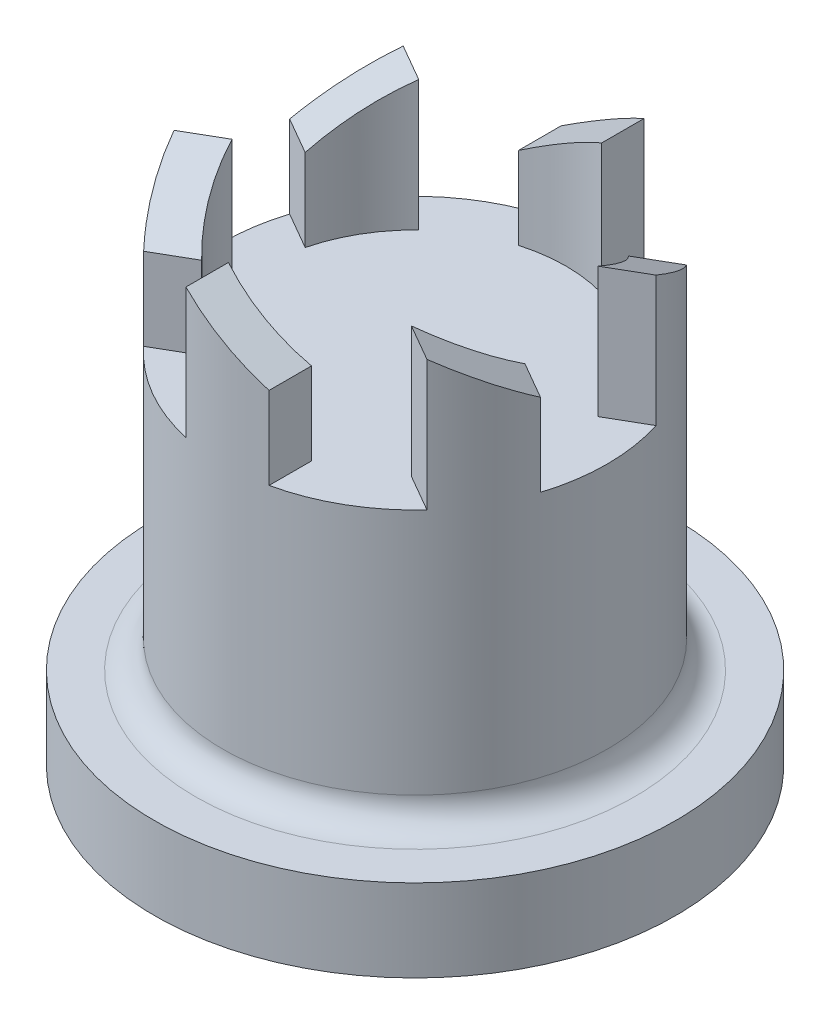
ISO-10303-21;
HEADER;
FILE_DESCRIPTION(('STEP AP214'),'2;1');
FILE_NAME('part.step','',(''),(''),'','','');
FILE_SCHEMA(('AUTOMOTIVE_DESIGN { 1 0 10303 214 1 1 1 1 }'));
ENDSEC;
DATA;
#1=APPLICATION_CONTEXT('core data for automotive mechanical design processes');
#2=APPLICATION_PROTOCOL_DEFINITION('international standard','automotive_design',2000,#1);
#3=PRODUCT_CONTEXT('',#1,'mechanical');
#4=PRODUCT('Part','Part','',(#3));
#5=PRODUCT_RELATED_PRODUCT_CATEGORY('part','',(#4));
#6=PRODUCT_DEFINITION_FORMATION('','',#4);
#7=PRODUCT_DEFINITION_CONTEXT('part definition',#1,'design');
#8=PRODUCT_DEFINITION('design','',#6,#7);
#9=PRODUCT_DEFINITION_SHAPE('','',#8);
#10=(LENGTH_UNIT() NAMED_UNIT(*) SI_UNIT(.MILLI.,.METRE.));
#11=(NAMED_UNIT(*) PLANE_ANGLE_UNIT() SI_UNIT($,.RADIAN.));
#12=(NAMED_UNIT(*) SI_UNIT($,.STERADIAN.) SOLID_ANGLE_UNIT());
#13=UNCERTAINTY_MEASURE_WITH_UNIT(LENGTH_MEASURE(1.E-05),#10,'distance_accuracy_value','');
#14=(GEOMETRIC_REPRESENTATION_CONTEXT(3) GLOBAL_UNCERTAINTY_ASSIGNED_CONTEXT((#13)) GLOBAL_UNIT_ASSIGNED_CONTEXT((#10,
#11,#12)) REPRESENTATION_CONTEXT('',''));
#15=CARTESIAN_POINT('',(0.,0.,0.));
#16=DIRECTION('',(0.,0.,1.));
#17=DIRECTION('',(1.,0.,0.));
#18=AXIS2_PLACEMENT_3D('',#15,#16,#17);
#19=CARTESIAN_POINT('',(0.,10.,0.));
#20=DIRECTION('',(0.,1.,0.));
#21=DIRECTION('',(0.,0.,1.));
#22=AXIS2_PLACEMENT_3D('',#19,#20,#21);
#23=PLANE('',#22);
#24=CARTESIAN_POINT('',(0.,10.,0.));
#25=DIRECTION('',(0.,1.,0.));
#26=DIRECTION('',(0.,0.,1.));
#27=AXIS2_PLACEMENT_3D('',#24,#25,#26);
#28=CIRCLE('',#27,7.);
#29=CARTESIAN_POINT('',(-6.67574526607751,10.,-2.10580747990972));
#30=VERTEX_POINT('',#29);
#31=CARTESIAN_POINT('',(-6.67574526607751,10.,2.10580747990973));
#32=VERTEX_POINT('',#31);
#33=EDGE_CURVE('E397',#30,#32,#28,.T.);
#34=ORIENTED_EDGE('',*,*,#33,.T.);
#35=DIRECTION('',(-0.866025403784438,0.,0.500000000000002));
#36=VECTOR('',#35,1.);
#37=CARTESIAN_POINT('',(-0.757094929978831,10.,-1.31132688487613));
#38=LINE('',#37,#36);
#39=CARTESIAN_POINT('',(-5.33616926886011,10.,1.3324029173163));
#40=VERTEX_POINT('',#39);
#41=EDGE_CURVE('E256',#40,#32,#38,.T.);
#42=ORIENTED_EDGE('',*,*,#41,.F.);
#43=CARTESIAN_POINT('',(0.,10.,0.));
#44=DIRECTION('',(0.,1.,0.));
#45=DIRECTION('',(0.,0.,1.));
#46=AXIS2_PLACEMENT_3D('',#43,#44,#45);
#47=CIRCLE('',#46,5.5);
#48=CARTESIAN_POINT('',(-3.82197940890246,10.,3.95505668706855));
#49=VERTEX_POINT('',#48);
#50=EDGE_CURVE('E249',#40,#49,#47,.T.);
#51=ORIENTED_EDGE('',*,*,#50,.T.);
#52=DIRECTION('',(0.866025403784439,0.,-0.5));
#53=VECTOR('',#52,1.);
#54=CARTESIAN_POINT('',(0.757094929978827,10.,1.31132688487613));
#55=LINE('',#54,#53);
#56=CARTESIAN_POINT('',(-5.16155540611986,10.,4.72846124966197));
#57=VERTEX_POINT('',#56);
#58=EDGE_CURVE('E260',#57,#49,#55,.T.);
#59=ORIENTED_EDGE('',*,*,#58,.F.);
#60=CARTESIAN_POINT('',(-1.51418985995765,10.,6.83426872957169));
#61=VERTEX_POINT('',#60);
#62=EDGE_CURVE('E402',#57,#61,#28,.T.);
#63=ORIENTED_EDGE('',*,*,#62,.T.);
#64=DIRECTION('',(0.,0.,1.));
#65=VECTOR('',#64,1.);
#66=CARTESIAN_POINT('',(-1.51418985995765,10.,0.));
#67=LINE('',#66,#65);
#68=CARTESIAN_POINT('',(-1.51418985995765,10.,5.28745960438483));
#69=VERTEX_POINT('',#68);
#70=EDGE_CURVE('E280',#69,#61,#67,.T.);
#71=ORIENTED_EDGE('',*,*,#70,.F.);
#72=CARTESIAN_POINT('',(0.,10.,0.));
#73=DIRECTION('',(0.,1.,0.));
#74=DIRECTION('',(0.,0.,1.));
#75=AXIS2_PLACEMENT_3D('',#72,#73,#74);
#76=CIRCLE('',#75,5.5);
#77=CARTESIAN_POINT('',(1.51418985995765,10.,5.28745960438483));
#78=VERTEX_POINT('',#77);
#79=EDGE_CURVE('E276',#69,#78,#76,.T.);
#80=ORIENTED_EDGE('',*,*,#79,.T.);
#81=DIRECTION('',(0.,0.,-1.));
#82=VECTOR('',#81,1.);
#83=CARTESIAN_POINT('',(1.51418985995765,10.,0.));
#84=LINE('',#83,#82);
#85=CARTESIAN_POINT('',(1.51418985995765,10.,6.83426872957169));
#86=VERTEX_POINT('',#85);
#87=EDGE_CURVE('E284',#86,#78,#84,.T.);
#88=ORIENTED_EDGE('',*,*,#87,.F.);
#89=CARTESIAN_POINT('',(5.16155540611986,10.,4.72846124966197));
#90=VERTEX_POINT('',#89);
#91=EDGE_CURVE('E565',#86,#90,#28,.T.);
#92=ORIENTED_EDGE('',*,*,#91,.T.);
#93=DIRECTION('',(0.86602540378444,0.,0.499999999999999));
#94=VECTOR('',#93,1.);
#95=CARTESIAN_POINT('',(-0.757094929978826,10.,1.31132688487613));
#96=LINE('',#95,#94);
#97=CARTESIAN_POINT('',(3.82197940890246,10.,3.95505668706854));
#98=VERTEX_POINT('',#97);
#99=EDGE_CURVE('E304',#98,#90,#96,.T.);
#100=ORIENTED_EDGE('',*,*,#99,.F.);
#101=CARTESIAN_POINT('',(0.,10.,0.));
#102=DIRECTION('',(0.,1.,0.));
#103=DIRECTION('',(0.,0.,1.));
#104=AXIS2_PLACEMENT_3D('',#101,#102,#103);
#105=CIRCLE('',#104,5.5);
#106=CARTESIAN_POINT('',(5.33616926886011,10.,1.33240291731629));
#107=VERTEX_POINT('',#106);
#108=EDGE_CURVE('E300',#98,#107,#105,.T.);
#109=ORIENTED_EDGE('',*,*,#108,.T.);
#110=DIRECTION('',(-0.866025403784438,0.,-0.500000000000001));
#111=VECTOR('',#110,1.);
#112=CARTESIAN_POINT('',(0.757094929978829,10.,-1.31132688487613));
#113=LINE('',#112,#111);
#114=CARTESIAN_POINT('',(6.67574526607751,10.,2.10580747990972));
#115=VERTEX_POINT('',#114);
#116=EDGE_CURVE('E308',#115,#107,#113,.T.);
#117=ORIENTED_EDGE('',*,*,#116,.F.);
#118=CARTESIAN_POINT('',(6.67574526607751,10.,-2.10580747990972));
#119=VERTEX_POINT('',#118);
#120=EDGE_CURVE('E560',#115,#119,#28,.T.);
#121=ORIENTED_EDGE('',*,*,#120,.T.);
#122=DIRECTION('',(0.866025403784438,0.,-0.500000000000001));
#123=VECTOR('',#122,1.);
#124=CARTESIAN_POINT('',(0.757094929978829,10.,1.31132688487613));
#125=LINE('',#124,#123);
#126=CARTESIAN_POINT('',(5.33616926886011,10.,-1.33240291731629));
#127=VERTEX_POINT('',#126);
#128=EDGE_CURVE('E328',#127,#119,#125,.T.);
#129=ORIENTED_EDGE('',*,*,#128,.F.);
#130=CARTESIAN_POINT('',(0.,10.,0.));
#131=DIRECTION('',(0.,1.,0.));
#132=DIRECTION('',(0.,0.,1.));
#133=AXIS2_PLACEMENT_3D('',#130,#131,#132);
#134=CIRCLE('',#133,5.5);
#135=CARTESIAN_POINT('',(3.82197940890246,10.,-3.95505668706854));
#136=VERTEX_POINT('',#135);
#137=EDGE_CURVE('E324',#127,#136,#134,.T.);
#138=ORIENTED_EDGE('',*,*,#137,.T.);
#139=DIRECTION('',(-0.86602540378444,0.,0.499999999999999));
#140=VECTOR('',#139,1.);
#141=CARTESIAN_POINT('',(-0.757094929978826,10.,-1.31132688487613));
#142=LINE('',#141,#140);
#143=CARTESIAN_POINT('',(5.16155540611986,10.,-4.72846124966197));
#144=VERTEX_POINT('',#143);
#145=EDGE_CURVE('E332',#144,#136,#142,.T.);
#146=ORIENTED_EDGE('',*,*,#145,.F.);
#147=CARTESIAN_POINT('',(1.51418985995765,10.,-6.83426872957169));
#148=VERTEX_POINT('',#147);
#149=EDGE_CURVE('E566',#144,#148,#28,.T.);
#150=ORIENTED_EDGE('',*,*,#149,.T.);
#151=DIRECTION('',(0.,0.,-1.));
#152=VECTOR('',#151,1.);
#153=CARTESIAN_POINT('',(1.51418985995766,10.,0.));
#154=LINE('',#153,#152);
#155=CARTESIAN_POINT('',(1.51418985995765,10.,-5.28745960438483));
#156=VERTEX_POINT('',#155);
#157=EDGE_CURVE('E352',#156,#148,#154,.T.);
#158=ORIENTED_EDGE('',*,*,#157,.F.);
#159=CARTESIAN_POINT('',(0.,10.,0.));
#160=DIRECTION('',(0.,1.,0.));
#161=DIRECTION('',(0.,0.,1.));
#162=AXIS2_PLACEMENT_3D('',#159,#160,#161);
#163=CIRCLE('',#162,5.5);
#164=CARTESIAN_POINT('',(-1.51418985995765,10.,-5.28745960438483));
#165=VERTEX_POINT('',#164);
#166=EDGE_CURVE('E348',#156,#165,#163,.T.);
#167=ORIENTED_EDGE('',*,*,#166,.T.);
#168=DIRECTION('',(0.,0.,1.));
#169=VECTOR('',#168,1.);
#170=CARTESIAN_POINT('',(-1.51418985995766,10.,0.));
#171=LINE('',#170,#169);
#172=CARTESIAN_POINT('',(-1.51418985995765,10.,-6.83426872957169));
#173=VERTEX_POINT('',#172);
#174=EDGE_CURVE('E356',#173,#165,#171,.T.);
#175=ORIENTED_EDGE('',*,*,#174,.F.);
#176=CARTESIAN_POINT('',(-5.16155540611986,10.,-4.72846124966197));
#177=VERTEX_POINT('',#176);
#178=EDGE_CURVE('E396',#173,#177,#28,.T.);
#179=ORIENTED_EDGE('',*,*,#178,.T.);
#180=DIRECTION('',(-0.866025403784439,0.,-0.5));
#181=VECTOR('',#180,1.);
#182=CARTESIAN_POINT('',(0.757094929978822,10.,-1.31132688487612));
#183=LINE('',#182,#181);
#184=CARTESIAN_POINT('',(-3.82197940890246,10.,-3.95505668706854));
#185=VERTEX_POINT('',#184);
#186=EDGE_CURVE('E376',#185,#177,#183,.T.);
#187=ORIENTED_EDGE('',*,*,#186,.F.);
#188=CARTESIAN_POINT('',(0.,10.,0.));
#189=DIRECTION('',(0.,1.,0.));
#190=DIRECTION('',(0.,0.,1.));
#191=AXIS2_PLACEMENT_3D('',#188,#189,#190);
#192=CIRCLE('',#191,5.5);
#193=CARTESIAN_POINT('',(-5.33616926886011,10.,-1.33240291731629));
#194=VERTEX_POINT('',#193);
#195=EDGE_CURVE('E372',#185,#194,#192,.T.);
#196=ORIENTED_EDGE('',*,*,#195,.T.);
#197=DIRECTION('',(0.866025403784438,0.,0.5));
#198=VECTOR('',#197,1.);
#199=CARTESIAN_POINT('',(-0.757094929978828,10.,1.31132688487613));
#200=LINE('',#199,#198);
#201=EDGE_CURVE('E380',#30,#194,#200,.T.);
#202=ORIENTED_EDGE('',*,*,#201,.F.);
#203=EDGE_LOOP('',(#34,#42,#51,#59,#63,#71,#80,#88,#92,#100,#109,#117,#121,#129,#138,#146,#150,
#158,#167,#175,#179,#187,#196,#202));
#204=FACE_BOUND('',#203,.T.);
#205=ADVANCED_FACE('F43',(#204),#23,.T.);
#206=CARTESIAN_POINT('',(0.,10.,0.));
#207=DIRECTION('',(0.,-1.,0.));
#208=DIRECTION('',(0.,0.,-1.));
#209=AXIS2_PLACEMENT_3D('',#206,#207,#208);
#210=CYLINDRICAL_SURFACE('',#209,7.);
#211=CARTESIAN_POINT('',(0.,0.999999999999999,0.));
#212=DIRECTION('',(0.,-1.,0.));
#213=DIRECTION('',(0.,0.,-1.));
#214=AXIS2_PLACEMENT_3D('',#211,#212,#213);
#215=CIRCLE('',#214,7.);
#216=CARTESIAN_POINT('',(0.,0.999999999999999,-7.));
#217=VERTEX_POINT('',#216);
#218=EDGE_CURVE('E52',#217,#217,#215,.F.);
#219=ORIENTED_EDGE('',*,*,#218,.T.);
#220=EDGE_LOOP('',(#219));
#221=FACE_BOUND('',#220,.T.);
#222=DIRECTION('',(0.,-1.,0.));
#223=VECTOR('',#222,1.);
#224=CARTESIAN_POINT('',(1.51418985995765,15.,6.83426872957169));
#225=LINE('',#224,#223);
#226=CARTESIAN_POINT('',(1.51418985995765,13.,6.83426872957169));
#227=VERTEX_POINT('',#226);
#228=EDGE_CURVE('E291',#227,#86,#225,.T.);
#229=ORIENTED_EDGE('',*,*,#228,.F.);
#230=CARTESIAN_POINT('',(0.,13.8742179232507,0.));
#231=DIRECTION('',(0.499999999999996,0.866025403784441,0.));
#232=DIRECTION('',(0.866025403784441,-0.499999999999997,0.));
#233=AXIS2_PLACEMENT_3D('',#230,#231,#232);
#234=ELLIPSE('',#233,8.08290376865474,7.);
#235=CARTESIAN_POINT('',(-1.51418985995765,14.7484358465015,6.83426872957169));
#236=VERTEX_POINT('',#235);
#237=EDGE_CURVE('E427',#227,#236,#234,.F.);
#238=ORIENTED_EDGE('',*,*,#237,.T.);
#239=DIRECTION('',(0.,-1.,0.));
#240=VECTOR('',#239,1.);
#241=CARTESIAN_POINT('',(-1.51418985995765,15.,6.83426872957169));
#242=LINE('',#241,#240);
#243=EDGE_CURVE('E294',#236,#61,#242,.T.);
#244=ORIENTED_EDGE('',*,*,#243,.T.);
#245=ORIENTED_EDGE('',*,*,#62,.F.);
#246=DIRECTION('',(0.,-1.,0.));
#247=VECTOR('',#246,1.);
#248=CARTESIAN_POINT('',(-5.16155540611986,15.,4.72846124966197));
#249=LINE('',#248,#247);
#250=CARTESIAN_POINT('',(-5.16155540611986,13.,4.72846124966197));
#251=VERTEX_POINT('',#250);
#252=EDGE_CURVE('E267',#251,#57,#249,.T.);
#253=ORIENTED_EDGE('',*,*,#252,.F.);
#254=CARTESIAN_POINT('',(0.,13.8742179232507,0.));
#255=DIRECTION('',(0.249999999999998,0.866025403784441,0.433012701892216));
#256=DIRECTION('',(0.43301270189222,-0.499999999999996,0.750000000000002));
#257=AXIS2_PLACEMENT_3D('',#254,#255,#256);
#258=ELLIPSE('',#257,8.08290376865474,7.);
#259=CARTESIAN_POINT('',(-6.67574526607751,14.7484358465015,2.10580747990973));
#260=VERTEX_POINT('',#259);
#261=EDGE_CURVE('E424',#251,#260,#258,.F.);
#262=ORIENTED_EDGE('',*,*,#261,.T.);
#263=DIRECTION('',(0.,-1.,0.));
#264=VECTOR('',#263,1.);
#265=CARTESIAN_POINT('',(-6.67574526607751,15.,2.10580747990973));
#266=LINE('',#265,#264);
#267=EDGE_CURVE('E270',#260,#32,#266,.T.);
#268=ORIENTED_EDGE('',*,*,#267,.T.);
#269=ORIENTED_EDGE('',*,*,#33,.F.);
#270=DIRECTION('',(0.,-1.,0.));
#271=VECTOR('',#270,1.);
#272=CARTESIAN_POINT('',(-6.67574526607751,15.,-2.10580747990972));
#273=LINE('',#272,#271);
#274=CARTESIAN_POINT('',(-6.67574526607751,13.,-2.10580747990972));
#275=VERTEX_POINT('',#274);
#276=EDGE_CURVE('E387',#275,#30,#273,.T.);
#277=ORIENTED_EDGE('',*,*,#276,.F.);
#278=CARTESIAN_POINT('',(0.,13.8742179232507,0.));
#279=DIRECTION('',(-0.249999999999998,0.866025403784441,0.433012701892216));
#280=DIRECTION('',(-0.433012701892221,-0.499999999999996,0.750000000000002));
#281=AXIS2_PLACEMENT_3D('',#278,#279,#280);
#282=ELLIPSE('',#281,8.08290376865474,7.);
#283=CARTESIAN_POINT('',(-5.16155540611986,14.7484358465015,-4.72846124966197));
#284=VERTEX_POINT('',#283);
#285=EDGE_CURVE('E421',#275,#284,#282,.F.);
#286=ORIENTED_EDGE('',*,*,#285,.T.);
#287=DIRECTION('',(0.,-1.,0.));
#288=VECTOR('',#287,1.);
#289=CARTESIAN_POINT('',(-5.16155540611986,15.,-4.72846124966197));
#290=LINE('',#289,#288);
#291=EDGE_CURVE('E390',#284,#177,#290,.T.);
#292=ORIENTED_EDGE('',*,*,#291,.T.);
#293=ORIENTED_EDGE('',*,*,#178,.F.);
#294=DIRECTION('',(0.,-1.,0.));
#295=VECTOR('',#294,1.);
#296=CARTESIAN_POINT('',(-1.51418985995765,15.,-6.83426872957169));
#297=LINE('',#296,#295);
#298=CARTESIAN_POINT('',(-1.51418985995765,13.,-6.83426872957169));
#299=VERTEX_POINT('',#298);
#300=EDGE_CURVE('E363',#299,#173,#297,.T.);
#301=ORIENTED_EDGE('',*,*,#300,.F.);
#302=CARTESIAN_POINT('',(0.,13.8742179232507,0.));
#303=DIRECTION('',(-0.499999999999996,0.866025403784441,0.));
#304=DIRECTION('',(-0.866025403784441,-0.499999999999997,0.));
#305=AXIS2_PLACEMENT_3D('',#302,#303,#304);
#306=ELLIPSE('',#305,8.08290376865474,7.);
#307=CARTESIAN_POINT('',(1.51418985995765,14.7484358465015,-6.83426872957169));
#308=VERTEX_POINT('',#307);
#309=EDGE_CURVE('E418',#299,#308,#306,.F.);
#310=ORIENTED_EDGE('',*,*,#309,.T.);
#311=DIRECTION('',(0.,-1.,0.));
#312=VECTOR('',#311,1.);
#313=CARTESIAN_POINT('',(1.51418985995765,15.,-6.83426872957169));
#314=LINE('',#313,#312);
#315=EDGE_CURVE('E366',#308,#148,#314,.T.);
#316=ORIENTED_EDGE('',*,*,#315,.T.);
#317=ORIENTED_EDGE('',*,*,#149,.F.);
#318=DIRECTION('',(0.,-1.,0.));
#319=VECTOR('',#318,1.);
#320=CARTESIAN_POINT('',(5.16155540611986,15.,-4.72846124966197));
#321=LINE('',#320,#319);
#322=CARTESIAN_POINT('',(5.16155540611986,13.,-4.72846124966197));
#323=VERTEX_POINT('',#322);
#324=EDGE_CURVE('E339',#323,#144,#321,.T.);
#325=ORIENTED_EDGE('',*,*,#324,.F.);
#326=CARTESIAN_POINT('',(0.,13.8742179232507,0.));
#327=DIRECTION('',(-0.249999999999998,0.866025403784441,-0.433012701892217));
#328=DIRECTION('',(-0.433012701892219,-0.499999999999997,-0.750000000000002));
#329=AXIS2_PLACEMENT_3D('',#326,#327,#328);
#330=ELLIPSE('',#329,8.08290376865474,7.);
#331=CARTESIAN_POINT('',(6.67574526607751,14.7484358465015,-2.10580747990972));
#332=VERTEX_POINT('',#331);
#333=EDGE_CURVE('E415',#323,#332,#330,.F.);
#334=ORIENTED_EDGE('',*,*,#333,.T.);
#335=DIRECTION('',(0.,-1.,0.));
#336=VECTOR('',#335,1.);
#337=CARTESIAN_POINT('',(6.67574526607751,15.,-2.10580747990972));
#338=LINE('',#337,#336);
#339=EDGE_CURVE('E342',#332,#119,#338,.T.);
#340=ORIENTED_EDGE('',*,*,#339,.T.);
#341=ORIENTED_EDGE('',*,*,#120,.F.);
#342=DIRECTION('',(0.,-1.,0.));
#343=VECTOR('',#342,1.);
#344=CARTESIAN_POINT('',(6.67574526607751,15.,2.10580747990972));
#345=LINE('',#344,#343);
#346=CARTESIAN_POINT('',(6.67574526607751,13.,2.10580747990972));
#347=VERTEX_POINT('',#346);
#348=EDGE_CURVE('E315',#347,#115,#345,.T.);
#349=ORIENTED_EDGE('',*,*,#348,.F.);
#350=CARTESIAN_POINT('',(0.,13.8742179232507,0.));
#351=DIRECTION('',(0.249999999999999,0.866025403784441,-0.433012701892216));
#352=DIRECTION('',(0.433012701892221,-0.499999999999997,-0.750000000000001));
#353=AXIS2_PLACEMENT_3D('',#350,#351,#352);
#354=ELLIPSE('',#353,8.08290376865474,7.);
#355=CARTESIAN_POINT('',(5.16155540611986,14.7484358465015,4.72846124966197));
#356=VERTEX_POINT('',#355);
#357=EDGE_CURVE('E412',#347,#356,#354,.F.);
#358=ORIENTED_EDGE('',*,*,#357,.T.);
#359=DIRECTION('',(0.,-1.,0.));
#360=VECTOR('',#359,1.);
#361=CARTESIAN_POINT('',(5.16155540611986,15.,4.72846124966197));
#362=LINE('',#361,#360);
#363=EDGE_CURVE('E318',#356,#90,#362,.T.);
#364=ORIENTED_EDGE('',*,*,#363,.T.);
#365=ORIENTED_EDGE('',*,*,#91,.F.);
#366=EDGE_LOOP('',(#229,#238,#244,#245,#253,#262,#268,#269,#277,#286,#292,#293,#301,#310,#316,
#317,#325,#334,#340,#341,#349,#358,#364,#365));
#367=FACE_BOUND('',#366,.T.);
#368=ADVANCED_FACE('F482',(#221,#367),#210,.T.);
#369=CARTESIAN_POINT('',(0.,15.,0.));
#370=DIRECTION('',(0.,-1.,0.));
#371=DIRECTION('',(0.,0.,-1.));
#372=AXIS2_PLACEMENT_3D('',#369,#370,#371);
#373=CYLINDRICAL_SURFACE('',#372,5.5);
#374=DIRECTION('',(0.,-1.,0.));
#375=VECTOR('',#374,1.);
#376=CARTESIAN_POINT('',(-3.82197940890246,15.,-3.95505668706854));
#377=LINE('',#376,#375);
#378=CARTESIAN_POINT('',(-3.82197940890246,14.7484358465015,-3.95505668706854));
#379=VERTEX_POINT('',#378);
#380=EDGE_CURVE('E393',#379,#185,#377,.T.);
#381=ORIENTED_EDGE('',*,*,#380,.F.);
#382=CARTESIAN_POINT('',(0.,13.8742179232507,0.));
#383=DIRECTION('',(-0.249999999999998,0.866025403784441,0.433012701892216));
#384=DIRECTION('',(-0.433012701892221,-0.499999999999996,0.750000000000002));
#385=AXIS2_PLACEMENT_3D('',#382,#383,#384);
#386=ELLIPSE('',#385,6.35085296108587,5.5);
#387=CARTESIAN_POINT('',(-5.33616926886011,13.,-1.33240291731629));
#388=VERTEX_POINT('',#387);
#389=EDGE_CURVE('E443',#379,#388,#386,.T.);
#390=ORIENTED_EDGE('',*,*,#389,.T.);
#391=DIRECTION('',(0.,-1.,0.));
#392=VECTOR('',#391,1.);
#393=CARTESIAN_POINT('',(-5.33616926886011,15.,-1.33240291731629));
#394=LINE('',#393,#392);
#395=EDGE_CURVE('E384',#388,#194,#394,.T.);
#396=ORIENTED_EDGE('',*,*,#395,.T.);
#397=ORIENTED_EDGE('',*,*,#195,.F.);
#398=EDGE_LOOP('',(#381,#390,#396,#397));
#399=FACE_BOUND('',#398,.T.);
#400=ADVANCED_FACE('F498',(#399),#373,.F.);
#401=CARTESIAN_POINT('',(0.757094929978822,15.,-1.31132688487612));
#402=DIRECTION('',(-0.5,0.,0.866025403784439));
#403=DIRECTION('',(0.866025403784439,0.,0.5));
#404=AXIS2_PLACEMENT_3D('',#401,#402,#403);
#405=PLANE('',#404);
#406=ORIENTED_EDGE('',*,*,#291,.F.);
#407=DIRECTION('',(0.866025403784438,0.,0.5));
#408=VECTOR('',#407,1.);
#409=CARTESIAN_POINT('',(0.757094929978823,14.7484358465015,-1.31132688487612));
#410=LINE('',#409,#408);
#411=EDGE_CURVE('E440',#284,#379,#410,.T.);
#412=ORIENTED_EDGE('',*,*,#411,.T.);
#413=ORIENTED_EDGE('',*,*,#380,.T.);
#414=ORIENTED_EDGE('',*,*,#186,.T.);
#415=EDGE_LOOP('',(#406,#412,#413,#414));
#416=FACE_BOUND('',#415,.T.);
#417=ADVANCED_FACE('F642',(#416),#405,.F.);
#418=CARTESIAN_POINT('',(-0.757094929978828,15.,1.31132688487613));
#419=DIRECTION('',(0.5,0.,-0.866025403784438));
#420=DIRECTION('',(-0.866025403784438,0.,-0.5));
#421=AXIS2_PLACEMENT_3D('',#418,#419,#420);
#422=PLANE('',#421);
#423=ORIENTED_EDGE('',*,*,#395,.F.);
#424=DIRECTION('',(-0.866025403784438,0.,-0.5));
#425=VECTOR('',#424,1.);
#426=CARTESIAN_POINT('',(-6.67574526607751,13.,-2.10580747990972));
#427=LINE('',#426,#425);
#428=EDGE_CURVE('E446',#388,#275,#427,.T.);
#429=ORIENTED_EDGE('',*,*,#428,.T.);
#430=ORIENTED_EDGE('',*,*,#276,.T.);
#431=ORIENTED_EDGE('',*,*,#201,.T.);
#432=EDGE_LOOP('',(#423,#429,#430,#431));
#433=FACE_BOUND('',#432,.T.);
#434=ADVANCED_FACE('F639',(#433),#422,.F.);
#435=CARTESIAN_POINT('',(0.,15.,0.));
#436=DIRECTION('',(0.,-1.,0.));
#437=DIRECTION('',(0.,0.,-1.));
#438=AXIS2_PLACEMENT_3D('',#435,#436,#437);
#439=CYLINDRICAL_SURFACE('',#438,5.5);
#440=DIRECTION('',(0.,-1.,0.));
#441=VECTOR('',#440,1.);
#442=CARTESIAN_POINT('',(1.51418985995765,15.,-5.28745960438483));
#443=LINE('',#442,#441);
#444=CARTESIAN_POINT('',(1.51418985995765,14.7484358465015,-5.28745960438483));
#445=VERTEX_POINT('',#444);
#446=EDGE_CURVE('E369',#445,#156,#443,.T.);
#447=ORIENTED_EDGE('',*,*,#446,.F.);
#448=CARTESIAN_POINT('',(0.,13.8742179232507,0.));
#449=DIRECTION('',(-0.499999999999996,0.866025403784441,0.));
#450=DIRECTION('',(-0.866025403784441,-0.499999999999997,0.));
#451=AXIS2_PLACEMENT_3D('',#448,#449,#450);
#452=ELLIPSE('',#451,6.35085296108587,5.5);
#453=CARTESIAN_POINT('',(-1.51418985995765,13.,-5.28745960438483));
#454=VERTEX_POINT('',#453);
#455=EDGE_CURVE('E453',#445,#454,#452,.T.);
#456=ORIENTED_EDGE('',*,*,#455,.T.);
#457=DIRECTION('',(0.,-1.,0.));
#458=VECTOR('',#457,1.);
#459=CARTESIAN_POINT('',(-1.51418985995765,15.,-5.28745960438483));
#460=LINE('',#459,#458);
#461=EDGE_CURVE('E360',#454,#165,#460,.T.);
#462=ORIENTED_EDGE('',*,*,#461,.T.);
#463=ORIENTED_EDGE('',*,*,#166,.F.);
#464=EDGE_LOOP('',(#447,#456,#462,#463));
#465=FACE_BOUND('',#464,.T.);
#466=ADVANCED_FACE('F635',(#465),#439,.F.);
#467=CARTESIAN_POINT('',(1.51418985995766,15.,0.));
#468=DIRECTION('',(-1.,0.,0.));
#469=DIRECTION('',(0.,0.,1.));
#470=AXIS2_PLACEMENT_3D('',#467,#468,#469);
#471=PLANE('',#470);
#472=ORIENTED_EDGE('',*,*,#315,.F.);
#473=DIRECTION('',(0.,0.,1.));
#474=VECTOR('',#473,1.);
#475=CARTESIAN_POINT('',(1.51418985995766,14.7484358465015,0.));
#476=LINE('',#475,#474);
#477=EDGE_CURVE('E450',#308,#445,#476,.T.);
#478=ORIENTED_EDGE('',*,*,#477,.T.);
#479=ORIENTED_EDGE('',*,*,#446,.T.);
#480=ORIENTED_EDGE('',*,*,#157,.T.);
#481=EDGE_LOOP('',(#472,#478,#479,#480));
#482=FACE_BOUND('',#481,.T.);
#483=ADVANCED_FACE('F631',(#482),#471,.F.);
#484=CARTESIAN_POINT('',(-1.51418985995766,15.,0.));
#485=DIRECTION('',(1.,0.,0.));
#486=DIRECTION('',(0.,0.,-1.));
#487=AXIS2_PLACEMENT_3D('',#484,#485,#486);
#488=PLANE('',#487);
#489=ORIENTED_EDGE('',*,*,#461,.F.);
#490=DIRECTION('',(0.,0.,-1.));
#491=VECTOR('',#490,1.);
#492=CARTESIAN_POINT('',(-1.51418985995765,13.,-6.83426872957169));
#493=LINE('',#492,#491);
#494=EDGE_CURVE('E456',#454,#299,#493,.T.);
#495=ORIENTED_EDGE('',*,*,#494,.T.);
#496=ORIENTED_EDGE('',*,*,#300,.T.);
#497=ORIENTED_EDGE('',*,*,#174,.T.);
#498=EDGE_LOOP('',(#489,#495,#496,#497));
#499=FACE_BOUND('',#498,.T.);
#500=ADVANCED_FACE('F627',(#499),#488,.F.);
#501=CARTESIAN_POINT('',(0.,15.,0.));
#502=DIRECTION('',(0.,-1.,0.));
#503=DIRECTION('',(0.,0.,-1.));
#504=AXIS2_PLACEMENT_3D('',#501,#502,#503);
#505=CYLINDRICAL_SURFACE('',#504,5.5);
#506=DIRECTION('',(0.,-1.,0.));
#507=VECTOR('',#506,1.);
#508=CARTESIAN_POINT('',(5.33616926886011,15.,-1.33240291731629));
#509=LINE('',#508,#507);
#510=CARTESIAN_POINT('',(5.33616926886011,14.7484358465015,-1.33240291731629));
#511=VERTEX_POINT('',#510);
#512=EDGE_CURVE('E345',#511,#127,#509,.T.);
#513=ORIENTED_EDGE('',*,*,#512,.F.);
#514=CARTESIAN_POINT('',(0.,13.8742179232507,0.));
#515=DIRECTION('',(-0.249999999999998,0.866025403784441,-0.433012701892217));
#516=DIRECTION('',(-0.433012701892219,-0.499999999999997,-0.750000000000002));
#517=AXIS2_PLACEMENT_3D('',#514,#515,#516);
#518=ELLIPSE('',#517,6.35085296108587,5.5);
#519=CARTESIAN_POINT('',(3.82197940890246,13.,-3.95505668706854));
#520=VERTEX_POINT('',#519);
#521=EDGE_CURVE('E463',#511,#520,#518,.T.);
#522=ORIENTED_EDGE('',*,*,#521,.T.);
#523=DIRECTION('',(0.,-1.,0.));
#524=VECTOR('',#523,1.);
#525=CARTESIAN_POINT('',(3.82197940890246,15.,-3.95505668706854));
#526=LINE('',#525,#524);
#527=EDGE_CURVE('E336',#520,#136,#526,.T.);
#528=ORIENTED_EDGE('',*,*,#527,.T.);
#529=ORIENTED_EDGE('',*,*,#137,.F.);
#530=EDGE_LOOP('',(#513,#522,#528,#529));
#531=FACE_BOUND('',#530,.T.);
#532=ADVANCED_FACE('F623',(#531),#505,.F.);
#533=CARTESIAN_POINT('',(0.757094929978829,15.,1.31132688487613));
#534=DIRECTION('',(-0.500000000000001,0.,-0.866025403784438));
#535=DIRECTION('',(-0.866025403784438,0.,0.500000000000001));
#536=AXIS2_PLACEMENT_3D('',#533,#534,#535);
#537=PLANE('',#536);
#538=ORIENTED_EDGE('',*,*,#339,.F.);
#539=DIRECTION('',(-0.866025403784438,0.,0.500000000000001));
#540=VECTOR('',#539,1.);
#541=CARTESIAN_POINT('',(0.757094929978824,14.7484358465015,1.31132688487613));
#542=LINE('',#541,#540);
#543=EDGE_CURVE('E460',#332,#511,#542,.T.);
#544=ORIENTED_EDGE('',*,*,#543,.T.);
#545=ORIENTED_EDGE('',*,*,#512,.T.);
#546=ORIENTED_EDGE('',*,*,#128,.T.);
#547=EDGE_LOOP('',(#538,#544,#545,#546));
#548=FACE_BOUND('',#547,.T.);
#549=ADVANCED_FACE('F619',(#548),#537,.F.);
#550=CARTESIAN_POINT('',(-0.757094929978826,15.,-1.31132688487613));
#551=DIRECTION('',(0.499999999999999,0.,0.866025403784439));
#552=DIRECTION('',(0.86602540378444,0.,-0.499999999999999));
#553=AXIS2_PLACEMENT_3D('',#550,#551,#552);
#554=PLANE('',#553);
#555=ORIENTED_EDGE('',*,*,#527,.F.);
#556=DIRECTION('',(0.86602540378444,0.,-0.499999999999999));
#557=VECTOR('',#556,1.);
#558=CARTESIAN_POINT('',(5.16155540611986,13.,-4.72846124966197));
#559=LINE('',#558,#557);
#560=EDGE_CURVE('E466',#520,#323,#559,.T.);
#561=ORIENTED_EDGE('',*,*,#560,.T.);
#562=ORIENTED_EDGE('',*,*,#324,.T.);
#563=ORIENTED_EDGE('',*,*,#145,.T.);
#564=EDGE_LOOP('',(#555,#561,#562,#563));
#565=FACE_BOUND('',#564,.T.);
#566=ADVANCED_FACE('F616',(#565),#554,.F.);
#567=CARTESIAN_POINT('',(0.,15.,0.));
#568=DIRECTION('',(0.,-1.,0.));
#569=DIRECTION('',(0.,0.,-1.));
#570=AXIS2_PLACEMENT_3D('',#567,#568,#569);
#571=CYLINDRICAL_SURFACE('',#570,5.5);
#572=DIRECTION('',(0.,-1.,0.));
#573=VECTOR('',#572,1.);
#574=CARTESIAN_POINT('',(3.82197940890246,15.,3.95505668706854));
#575=LINE('',#574,#573);
#576=CARTESIAN_POINT('',(3.82197940890246,14.7484358465015,3.95505668706854));
#577=VERTEX_POINT('',#576);
#578=EDGE_CURVE('E321',#577,#98,#575,.T.);
#579=ORIENTED_EDGE('',*,*,#578,.F.);
#580=CARTESIAN_POINT('',(0.,13.8742179232507,0.));
#581=DIRECTION('',(0.249999999999999,0.866025403784441,-0.433012701892216));
#582=DIRECTION('',(0.433012701892221,-0.499999999999997,-0.750000000000001));
#583=AXIS2_PLACEMENT_3D('',#580,#581,#582);
#584=ELLIPSE('',#583,6.35085296108587,5.5);
#585=CARTESIAN_POINT('',(5.33616926886011,13.,1.33240291731629));
#586=VERTEX_POINT('',#585);
#587=EDGE_CURVE('E67',#577,#586,#584,.T.);
#588=ORIENTED_EDGE('',*,*,#587,.T.);
#589=DIRECTION('',(0.,-1.,0.));
#590=VECTOR('',#589,1.);
#591=CARTESIAN_POINT('',(5.33616926886011,15.,1.33240291731629));
#592=LINE('',#591,#590);
#593=EDGE_CURVE('E312',#586,#107,#592,.T.);
#594=ORIENTED_EDGE('',*,*,#593,.T.);
#595=ORIENTED_EDGE('',*,*,#108,.F.);
#596=EDGE_LOOP('',(#579,#588,#594,#595));
#597=FACE_BOUND('',#596,.T.);
#598=ADVANCED_FACE('F570',(#597),#571,.F.);
#599=CARTESIAN_POINT('',(-0.757094929978826,15.,1.31132688487613));
#600=DIRECTION('',(0.499999999999998,0.,-0.86602540378444));
#601=DIRECTION('',(-0.86602540378444,0.,-0.499999999999998));
#602=AXIS2_PLACEMENT_3D('',#599,#600,#601);
#603=PLANE('',#602);
#604=ORIENTED_EDGE('',*,*,#363,.F.);
#605=DIRECTION('',(-0.86602540378444,0.,-0.499999999999998));
#606=VECTOR('',#605,1.);
#607=CARTESIAN_POINT('',(-0.757094929978831,14.7484358465015,1.31132688487613));
#608=LINE('',#607,#606);
#609=EDGE_CURVE('E470',#356,#577,#608,.T.);
#610=ORIENTED_EDGE('',*,*,#609,.T.);
#611=ORIENTED_EDGE('',*,*,#578,.T.);
#612=ORIENTED_EDGE('',*,*,#99,.T.);
#613=EDGE_LOOP('',(#604,#610,#611,#612));
#614=FACE_BOUND('',#613,.T.);
#615=ADVANCED_FACE('F572',(#614),#603,.F.);
#616=CARTESIAN_POINT('',(0.757094929978829,15.,-1.31132688487613));
#617=DIRECTION('',(-0.500000000000001,0.,0.866025403784438));
#618=DIRECTION('',(0.866025403784438,0.,0.500000000000001));
#619=AXIS2_PLACEMENT_3D('',#616,#617,#618);
#620=PLANE('',#619);
#621=ORIENTED_EDGE('',*,*,#593,.F.);
#622=DIRECTION('',(0.866025403784438,0.,0.500000000000001));
#623=VECTOR('',#622,1.);
#624=CARTESIAN_POINT('',(6.67574526607751,13.,2.10580747990972));
#625=LINE('',#624,#623);
#626=EDGE_CURVE('E475',#586,#347,#625,.T.);
#627=ORIENTED_EDGE('',*,*,#626,.T.);
#628=ORIENTED_EDGE('',*,*,#348,.T.);
#629=ORIENTED_EDGE('',*,*,#116,.T.);
#630=EDGE_LOOP('',(#621,#627,#628,#629));
#631=FACE_BOUND('',#630,.T.);
#632=ADVANCED_FACE('F556',(#631),#620,.F.);
#633=CARTESIAN_POINT('',(0.,15.,0.));
#634=DIRECTION('',(0.,-1.,0.));
#635=DIRECTION('',(0.,0.,-1.));
#636=AXIS2_PLACEMENT_3D('',#633,#634,#635);
#637=CYLINDRICAL_SURFACE('',#636,5.5);
#638=DIRECTION('',(0.,-1.,0.));
#639=VECTOR('',#638,1.);
#640=CARTESIAN_POINT('',(-1.51418985995765,15.,5.28745960438483));
#641=LINE('',#640,#639);
#642=CARTESIAN_POINT('',(-1.51418985995765,14.7484358465015,5.28745960438483));
#643=VERTEX_POINT('',#642);
#644=EDGE_CURVE('E297',#643,#69,#641,.T.);
#645=ORIENTED_EDGE('',*,*,#644,.F.);
#646=CARTESIAN_POINT('',(0.,13.8742179232507,0.));
#647=DIRECTION('',(0.499999999999996,0.866025403784441,0.));
#648=DIRECTION('',(0.866025403784441,-0.499999999999997,0.));
#649=AXIS2_PLACEMENT_3D('',#646,#647,#648);
#650=ELLIPSE('',#649,6.35085296108587,5.5);
#651=CARTESIAN_POINT('',(1.51418985995765,13.,5.28745960438483));
#652=VERTEX_POINT('',#651);
#653=EDGE_CURVE('E405',#643,#652,#650,.T.);
#654=ORIENTED_EDGE('',*,*,#653,.T.);
#655=DIRECTION('',(0.,-1.,0.));
#656=VECTOR('',#655,1.);
#657=CARTESIAN_POINT('',(1.51418985995765,15.,5.28745960438483));
#658=LINE('',#657,#656);
#659=EDGE_CURVE('E288',#652,#78,#658,.T.);
#660=ORIENTED_EDGE('',*,*,#659,.T.);
#661=ORIENTED_EDGE('',*,*,#79,.F.);
#662=EDGE_LOOP('',(#645,#654,#660,#661));
#663=FACE_BOUND('',#662,.T.);
#664=ADVANCED_FACE('F590',(#663),#637,.F.);
#665=CARTESIAN_POINT('',(-1.51418985995765,15.,0.));
#666=DIRECTION('',(1.,0.,0.));
#667=DIRECTION('',(0.,0.,-1.));
#668=AXIS2_PLACEMENT_3D('',#665,#666,#667);
#669=PLANE('',#668);
#670=ORIENTED_EDGE('',*,*,#243,.F.);
#671=DIRECTION('',(0.,0.,-1.));
#672=VECTOR('',#671,1.);
#673=CARTESIAN_POINT('',(-1.51418985995765,14.7484358465015,0.));
#674=LINE('',#673,#672);
#675=EDGE_CURVE('E401',#236,#643,#674,.T.);
#676=ORIENTED_EDGE('',*,*,#675,.T.);
#677=ORIENTED_EDGE('',*,*,#644,.T.);
#678=ORIENTED_EDGE('',*,*,#70,.T.);
#679=EDGE_LOOP('',(#670,#676,#677,#678));
#680=FACE_BOUND('',#679,.T.);
#681=ADVANCED_FACE('F585',(#680),#669,.F.);
#682=CARTESIAN_POINT('',(1.51418985995765,15.,0.));
#683=DIRECTION('',(-1.,0.,0.));
#684=DIRECTION('',(0.,0.,1.));
#685=AXIS2_PLACEMENT_3D('',#682,#683,#684);
#686=PLANE('',#685);
#687=ORIENTED_EDGE('',*,*,#659,.F.);
#688=DIRECTION('',(0.,0.,1.));
#689=VECTOR('',#688,1.);
#690=CARTESIAN_POINT('',(1.51418985995765,13.,6.83426872957169));
#691=LINE('',#690,#689);
#692=EDGE_CURVE('E408',#652,#227,#691,.T.);
#693=ORIENTED_EDGE('',*,*,#692,.T.);
#694=ORIENTED_EDGE('',*,*,#228,.T.);
#695=ORIENTED_EDGE('',*,*,#87,.T.);
#696=EDGE_LOOP('',(#687,#693,#694,#695));
#697=FACE_BOUND('',#696,.T.);
#698=ADVANCED_FACE('F594',(#697),#686,.F.);
#699=CARTESIAN_POINT('',(0.,15.,0.));
#700=DIRECTION('',(0.,-1.,0.));
#701=DIRECTION('',(0.,0.,-1.));
#702=AXIS2_PLACEMENT_3D('',#699,#700,#701);
#703=CYLINDRICAL_SURFACE('',#702,5.5);
#704=DIRECTION('',(0.,-1.,0.));
#705=VECTOR('',#704,1.);
#706=CARTESIAN_POINT('',(-5.33616926886011,15.,1.3324029173163));
#707=LINE('',#706,#705);
#708=CARTESIAN_POINT('',(-5.33616926886011,14.7484358465015,1.3324029173163));
#709=VERTEX_POINT('',#708);
#710=EDGE_CURVE('E273',#709,#40,#707,.T.);
#711=ORIENTED_EDGE('',*,*,#710,.F.);
#712=CARTESIAN_POINT('',(0.,13.8742179232507,0.));
#713=DIRECTION('',(0.249999999999998,0.866025403784441,0.433012701892216));
#714=DIRECTION('',(0.43301270189222,-0.499999999999996,0.750000000000002));
#715=AXIS2_PLACEMENT_3D('',#712,#713,#714);
#716=ELLIPSE('',#715,6.35085296108587,5.5);
#717=CARTESIAN_POINT('',(-3.82197940890246,13.,3.95505668706855));
#718=VERTEX_POINT('',#717);
#719=EDGE_CURVE('E433',#709,#718,#716,.T.);
#720=ORIENTED_EDGE('',*,*,#719,.T.);
#721=DIRECTION('',(0.,-1.,0.));
#722=VECTOR('',#721,1.);
#723=CARTESIAN_POINT('',(-3.82197940890246,15.,3.95505668706855));
#724=LINE('',#723,#722);
#725=EDGE_CURVE('E264',#718,#49,#724,.T.);
#726=ORIENTED_EDGE('',*,*,#725,.T.);
#727=ORIENTED_EDGE('',*,*,#50,.F.);
#728=EDGE_LOOP('',(#711,#720,#726,#727));
#729=FACE_BOUND('',#728,.T.);
#730=ADVANCED_FACE('F596',(#729),#703,.F.);
#731=CARTESIAN_POINT('',(-0.757094929978831,15.,-1.31132688487613));
#732=DIRECTION('',(0.500000000000002,0.,0.866025403784438));
#733=DIRECTION('',(0.866025403784438,0.,-0.500000000000002));
#734=AXIS2_PLACEMENT_3D('',#731,#732,#733);
#735=PLANE('',#734);
#736=ORIENTED_EDGE('',*,*,#267,.F.);
#737=DIRECTION('',(0.866025403784438,0.,-0.500000000000002));
#738=VECTOR('',#737,1.);
#739=CARTESIAN_POINT('',(-0.757094929978827,14.7484358465015,-1.31132688487613));
#740=LINE('',#739,#738);
#741=EDGE_CURVE('E430',#260,#709,#740,.T.);
#742=ORIENTED_EDGE('',*,*,#741,.T.);
#743=ORIENTED_EDGE('',*,*,#710,.T.);
#744=ORIENTED_EDGE('',*,*,#41,.T.);
#745=EDGE_LOOP('',(#736,#742,#743,#744));
#746=FACE_BOUND('',#745,.T.);
#747=ADVANCED_FACE('F602',(#746),#735,.F.);
#748=CARTESIAN_POINT('',(0.757094929978827,15.,1.31132688487613));
#749=DIRECTION('',(-0.5,0.,-0.866025403784439));
#750=DIRECTION('',(-0.866025403784439,0.,0.5));
#751=AXIS2_PLACEMENT_3D('',#748,#749,#750);
#752=PLANE('',#751);
#753=ORIENTED_EDGE('',*,*,#725,.F.);
#754=DIRECTION('',(-0.866025403784439,0.,0.5));
#755=VECTOR('',#754,1.);
#756=CARTESIAN_POINT('',(-5.16155540611986,13.,4.72846124966197));
#757=LINE('',#756,#755);
#758=EDGE_CURVE('E436',#718,#251,#757,.T.);
#759=ORIENTED_EDGE('',*,*,#758,.T.);
#760=ORIENTED_EDGE('',*,*,#252,.T.);
#761=ORIENTED_EDGE('',*,*,#58,.T.);
#762=EDGE_LOOP('',(#753,#759,#760,#761));
#763=FACE_BOUND('',#762,.T.);
#764=ADVANCED_FACE('F511',(#763),#752,.F.);
#765=CARTESIAN_POINT('',(-1.94991175518017,15.,0.));
#766=DIRECTION('',(0.499999999999996,0.866025403784441,0.));
#767=DIRECTION('',(0.,0.,1.));
#768=AXIS2_PLACEMENT_3D('',#765,#766,#767);
#769=PLANE('',#768);
#770=ORIENTED_EDGE('',*,*,#237,.F.);
#771=ORIENTED_EDGE('',*,*,#692,.F.);
#772=ORIENTED_EDGE('',*,*,#653,.F.);
#773=ORIENTED_EDGE('',*,*,#675,.F.);
#774=EDGE_LOOP('',(#770,#771,#772,#773));
#775=FACE_BOUND('',#774,.T.);
#776=ADVANCED_FACE('F504',(#775),#769,.T.);
#777=CARTESIAN_POINT('',(-0.974955877590087,15.,-1.68867311512394));
#778=DIRECTION('',(0.249999999999998,0.866025403784441,0.433012701892216));
#779=DIRECTION('',(-0.866025403784439,0.,0.5));
#780=AXIS2_PLACEMENT_3D('',#777,#778,#779);
#781=PLANE('',#780);
#782=ORIENTED_EDGE('',*,*,#261,.F.);
#783=ORIENTED_EDGE('',*,*,#758,.F.);
#784=ORIENTED_EDGE('',*,*,#719,.F.);
#785=ORIENTED_EDGE('',*,*,#741,.F.);
#786=EDGE_LOOP('',(#782,#783,#784,#785));
#787=FACE_BOUND('',#786,.T.);
#788=ADVANCED_FACE('F510',(#787),#781,.T.);
#789=CARTESIAN_POINT('',(0.974955877590089,15.,-1.68867311512394));
#790=DIRECTION('',(-0.249999999999998,0.866025403784441,0.433012701892216));
#791=DIRECTION('',(-0.866025403784438,0.,-0.5));
#792=AXIS2_PLACEMENT_3D('',#789,#790,#791);
#793=PLANE('',#792);
#794=ORIENTED_EDGE('',*,*,#285,.F.);
#795=ORIENTED_EDGE('',*,*,#428,.F.);
#796=ORIENTED_EDGE('',*,*,#389,.F.);
#797=ORIENTED_EDGE('',*,*,#411,.F.);
#798=EDGE_LOOP('',(#794,#795,#796,#797));
#799=FACE_BOUND('',#798,.T.);
#800=ADVANCED_FACE('F518',(#799),#793,.T.);
#801=CARTESIAN_POINT('',(1.94991175518017,15.,0.));
#802=DIRECTION('',(-0.499999999999996,0.866025403784441,0.));
#803=DIRECTION('',(0.,0.,-1.));
#804=AXIS2_PLACEMENT_3D('',#801,#802,#803);
#805=PLANE('',#804);
#806=ORIENTED_EDGE('',*,*,#309,.F.);
#807=ORIENTED_EDGE('',*,*,#494,.F.);
#808=ORIENTED_EDGE('',*,*,#455,.F.);
#809=ORIENTED_EDGE('',*,*,#477,.F.);
#810=EDGE_LOOP('',(#806,#807,#808,#809));
#811=FACE_BOUND('',#810,.T.);
#812=ADVANCED_FACE('F525',(#811),#805,.T.);
#813=CARTESIAN_POINT('',(0.974955877590083,15.,1.68867311512393));
#814=DIRECTION('',(-0.249999999999998,0.866025403784441,-0.433012701892217));
#815=DIRECTION('',(0.86602540378444,0.,-0.499999999999999));
#816=AXIS2_PLACEMENT_3D('',#813,#814,#815);
#817=PLANE('',#816);
#818=ORIENTED_EDGE('',*,*,#333,.F.);
#819=ORIENTED_EDGE('',*,*,#560,.F.);
#820=ORIENTED_EDGE('',*,*,#521,.F.);
#821=ORIENTED_EDGE('',*,*,#543,.F.);
#822=EDGE_LOOP('',(#818,#819,#820,#821));
#823=FACE_BOUND('',#822,.T.);
#824=ADVANCED_FACE('F532',(#823),#817,.T.);
#825=CARTESIAN_POINT('',(-0.974955877590089,15.,1.68867311512393));
#826=DIRECTION('',(0.249999999999999,0.866025403784441,-0.433012701892216));
#827=DIRECTION('',(0.866025403784438,0.,0.500000000000001));
#828=AXIS2_PLACEMENT_3D('',#825,#826,#827);
#829=PLANE('',#828);
#830=ORIENTED_EDGE('',*,*,#357,.F.);
#831=ORIENTED_EDGE('',*,*,#626,.F.);
#832=ORIENTED_EDGE('',*,*,#587,.F.);
#833=ORIENTED_EDGE('',*,*,#609,.F.);
#834=EDGE_LOOP('',(#830,#831,#832,#833));
#835=FACE_BOUND('',#834,.T.);
#836=ADVANCED_FACE('F538',(#835),#829,.T.);
#837=CARTESIAN_POINT('',(0.,-3.,0.));
#838=DIRECTION('',(0.,1.,0.));
#839=DIRECTION('',(0.,0.,1.));
#840=AXIS2_PLACEMENT_3D('',#837,#838,#839);
#841=CYLINDRICAL_SURFACE('',#840,9.5);
#842=CARTESIAN_POINT('',(0.,-3.,0.));
#843=DIRECTION('',(0.,-1.,0.));
#844=DIRECTION('',(0.,0.,-1.));
#845=AXIS2_PLACEMENT_3D('',#842,#843,#844);
#846=CIRCLE('',#845,9.5);
#847=CARTESIAN_POINT('',(0.,-3.,-9.5));
#848=VERTEX_POINT('',#847);
#849=EDGE_CURVE('E245',#848,#848,#846,.T.);
#850=ORIENTED_EDGE('',*,*,#849,.F.);
#851=EDGE_LOOP('',(#850));
#852=FACE_BOUND('',#851,.T.);
#853=CARTESIAN_POINT('',(0.,0.,0.));
#854=DIRECTION('',(0.,-1.,0.));
#855=DIRECTION('',(0.,0.,-1.));
#856=AXIS2_PLACEMENT_3D('',#853,#854,#855);
#857=CIRCLE('',#856,9.5);
#858=CARTESIAN_POINT('',(0.,0.,-9.5));
#859=VERTEX_POINT('',#858);
#860=EDGE_CURVE('E243',#859,#859,#857,.T.);
#861=ORIENTED_EDGE('',*,*,#860,.T.);
#862=EDGE_LOOP('',(#861));
#863=FACE_BOUND('',#862,.T.);
#864=ADVANCED_FACE('F543',(#852,#863),#841,.T.);
#865=CARTESIAN_POINT('',(0.,-3.,0.));
#866=DIRECTION('',(0.,-1.,0.));
#867=DIRECTION('',(0.,0.,-1.));
#868=AXIS2_PLACEMENT_3D('',#865,#866,#867);
#869=PLANE('',#868);
#870=CARTESIAN_POINT('',(0.,-3.,0.));
#871=DIRECTION('',(0.,-1.,0.));
#872=DIRECTION('',(0.,0.,-1.));
#873=AXIS2_PLACEMENT_3D('',#870,#871,#872);
#874=CIRCLE('',#873,1.75);
#875=CARTESIAN_POINT('',(-1.22474487139159,-3.,1.25));
#876=VERTEX_POINT('',#875);
#877=CARTESIAN_POINT('',(1.22474487139159,-3.,1.25));
#878=VERTEX_POINT('',#877);
#879=EDGE_CURVE('E59',#876,#878,#874,.T.);
#880=ORIENTED_EDGE('',*,*,#879,.F.);
#881=DIRECTION('',(-1.,0.,0.));
#882=VECTOR('',#881,1.);
#883=CARTESIAN_POINT('',(1.22474487139159,-3.,1.25));
#884=LINE('',#883,#882);
#885=EDGE_CURVE('E232',#878,#876,#884,.T.);
#886=ORIENTED_EDGE('',*,*,#885,.F.);
#887=EDGE_LOOP('',(#880,#886));
#888=FACE_BOUND('',#887,.T.);
#889=ORIENTED_EDGE('',*,*,#849,.T.);
#890=EDGE_LOOP('',(#889));
#891=FACE_BOUND('',#890,.T.);
#892=ADVANCED_FACE('F548',(#888,#891),#869,.T.);
#893=CARTESIAN_POINT('',(0.,0.,0.));
#894=DIRECTION('',(0.,-1.,0.));
#895=DIRECTION('',(0.,0.,-1.));
#896=AXIS2_PLACEMENT_3D('',#893,#894,#895);
#897=PLANE('',#896);
#898=CARTESIAN_POINT('',(0.,0.,0.));
#899=DIRECTION('',(0.,-1.,0.));
#900=DIRECTION('',(0.,0.,-1.));
#901=AXIS2_PLACEMENT_3D('',#898,#899,#900);
#902=CIRCLE('',#901,8.);
#903=CARTESIAN_POINT('',(0.,0.,-8.));
#904=VERTEX_POINT('',#903);
#905=EDGE_CURVE('E11',#904,#904,#902,.T.);
#906=ORIENTED_EDGE('',*,*,#905,.T.);
#907=EDGE_LOOP('',(#906));
#908=FACE_BOUND('',#907,.T.);
#909=ORIENTED_EDGE('',*,*,#860,.F.);
#910=EDGE_LOOP('',(#909));
#911=FACE_BOUND('',#910,.T.);
#912=ADVANCED_FACE('F679',(#908,#911),#897,.F.);
#913=CARTESIAN_POINT('',(0.,7.,0.));
#914=DIRECTION('',(0.,-1.,0.));
#915=DIRECTION('',(0.,0.,-1.));
#916=AXIS2_PLACEMENT_3D('',#913,#914,#915);
#917=CYLINDRICAL_SURFACE('',#916,1.75);
#918=ORIENTED_EDGE('',*,*,#879,.T.);
#919=DIRECTION('',(0.,-1.,0.));
#920=VECTOR('',#919,1.);
#921=CARTESIAN_POINT('',(1.22474487139159,7.,1.25));
#922=LINE('',#921,#920);
#923=CARTESIAN_POINT('',(1.22474487139159,7.,1.25));
#924=VERTEX_POINT('',#923);
#925=EDGE_CURVE('E216',#924,#878,#922,.T.);
#926=ORIENTED_EDGE('',*,*,#925,.F.);
#927=CARTESIAN_POINT('',(0.,7.,0.));
#928=DIRECTION('',(0.,-1.,0.));
#929=DIRECTION('',(0.,0.,-1.));
#930=AXIS2_PLACEMENT_3D('',#927,#928,#929);
#931=CIRCLE('',#930,1.75);
#932=CARTESIAN_POINT('',(-1.22474487139159,7.,1.25));
#933=VERTEX_POINT('',#932);
#934=EDGE_CURVE('E219',#933,#924,#931,.T.);
#935=ORIENTED_EDGE('',*,*,#934,.F.);
#936=DIRECTION('',(0.,-1.,0.));
#937=VECTOR('',#936,1.);
#938=CARTESIAN_POINT('',(-1.22474487139159,7.,1.25));
#939=LINE('',#938,#937);
#940=EDGE_CURVE('E226',#933,#876,#939,.T.);
#941=ORIENTED_EDGE('',*,*,#940,.T.);
#942=EDGE_LOOP('',(#918,#926,#935,#941));
#943=FACE_BOUND('',#942,.T.);
#944=ADVANCED_FACE('F218',(#943),#917,.F.);
#945=CARTESIAN_POINT('',(1.22474487139159,7.,1.25));
#946=DIRECTION('',(0.,0.,1.));
#947=DIRECTION('',(1.,0.,0.));
#948=AXIS2_PLACEMENT_3D('',#945,#946,#947);
#949=PLANE('',#948);
#950=ORIENTED_EDGE('',*,*,#885,.T.);
#951=ORIENTED_EDGE('',*,*,#940,.F.);
#952=DIRECTION('',(-1.,0.,0.));
#953=VECTOR('',#952,1.);
#954=CARTESIAN_POINT('',(1.22474487139159,7.,1.25));
#955=LINE('',#954,#953);
#956=EDGE_CURVE('E227',#924,#933,#955,.T.);
#957=ORIENTED_EDGE('',*,*,#956,.F.);
#958=ORIENTED_EDGE('',*,*,#925,.T.);
#959=EDGE_LOOP('',(#950,#951,#957,#958));
#960=FACE_BOUND('',#959,.T.);
#961=ADVANCED_FACE('F234',(#960),#949,.F.);
#962=CARTESIAN_POINT('',(0.,7.,0.));
#963=DIRECTION('',(0.,-1.,0.));
#964=DIRECTION('',(0.,0.,-1.));
#965=AXIS2_PLACEMENT_3D('',#962,#963,#964);
#966=PLANE('',#965);
#967=ORIENTED_EDGE('',*,*,#934,.T.);
#968=ORIENTED_EDGE('',*,*,#956,.T.);
#969=EDGE_LOOP('',(#967,#968));
#970=FACE_BOUND('',#969,.T.);
#971=ADVANCED_FACE('F230',(#970),#966,.T.);
#972=CARTESIAN_POINT('',(0.,0.999999999999999,0.));
#973=DIRECTION('',(0.,-1.,0.));
#974=DIRECTION('',(0.,0.,-1.));
#975=AXIS2_PLACEMENT_3D('',#972,#973,#974);
#976=TOROIDAL_SURFACE('',#975,8.,1.);
#977=ORIENTED_EDGE('',*,*,#905,.F.);
#978=EDGE_LOOP('',(#977));
#979=FACE_BOUND('',#978,.T.);
#980=ORIENTED_EDGE('',*,*,#218,.F.);
#981=EDGE_LOOP('',(#980));
#982=FACE_BOUND('',#981,.T.);
#983=ADVANCED_FACE('F45',(#979,#982),#976,.F.);
#984=CLOSED_SHELL('',(#205,#368,#400,#417,#434,#466,#483,#500,#532,#549,#566,#598,#615,#632,
#664,#681,#698,#730,#747,#764,#776,#788,#800,#812,#824,#836,#864,#892,#912,#944,#961,#971,#983));
#985=MANIFOLD_SOLID_BREP('B2',#984);
#986=ADVANCED_BREP_SHAPE_REPRESENTATION('',(#18,#985),#14);
#987=SHAPE_DEFINITION_REPRESENTATION(#9,#986);
ENDSEC;
END-ISO-10303-21;
